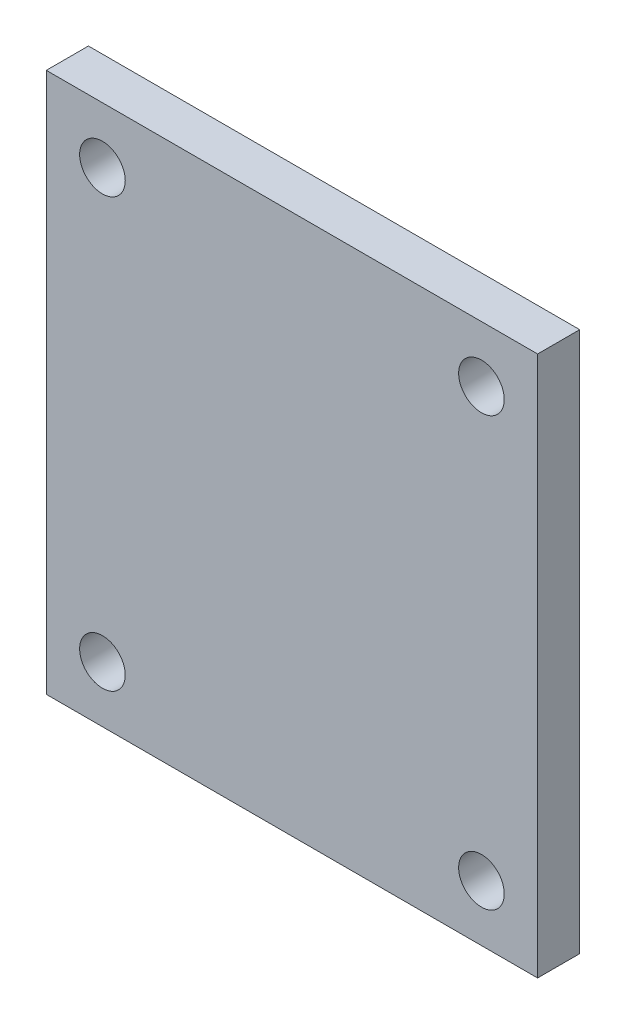
ISO-10303-21;
HEADER;
FILE_DESCRIPTION(('STEP AP214'),'2;1');
FILE_NAME('part.step','',(''),(''),'','','');
FILE_SCHEMA(('AUTOMOTIVE_DESIGN { 1 0 10303 214 1 1 1 1 }'));
ENDSEC;
DATA;
#1=APPLICATION_CONTEXT('core data for automotive mechanical design processes');
#2=APPLICATION_PROTOCOL_DEFINITION('international standard','automotive_design',2000,#1);
#3=PRODUCT_CONTEXT('',#1,'mechanical');
#4=PRODUCT('Part','Part','',(#3));
#5=PRODUCT_RELATED_PRODUCT_CATEGORY('part','',(#4));
#6=PRODUCT_DEFINITION_FORMATION('','',#4);
#7=PRODUCT_DEFINITION_CONTEXT('part definition',#1,'design');
#8=PRODUCT_DEFINITION('design','',#6,#7);
#9=PRODUCT_DEFINITION_SHAPE('','',#8);
#10=(LENGTH_UNIT() NAMED_UNIT(*) SI_UNIT(.MILLI.,.METRE.));
#11=(NAMED_UNIT(*) PLANE_ANGLE_UNIT() SI_UNIT($,.RADIAN.));
#12=(NAMED_UNIT(*) SI_UNIT($,.STERADIAN.) SOLID_ANGLE_UNIT());
#13=UNCERTAINTY_MEASURE_WITH_UNIT(LENGTH_MEASURE(1.E-05),#10,'distance_accuracy_value','');
#14=(GEOMETRIC_REPRESENTATION_CONTEXT(3) GLOBAL_UNCERTAINTY_ASSIGNED_CONTEXT((#13)) GLOBAL_UNIT_ASSIGNED_CONTEXT((#10,
#11,#12)) REPRESENTATION_CONTEXT('',''));
#15=CARTESIAN_POINT('',(0.,0.,0.));
#16=DIRECTION('',(0.,0.,1.));
#17=DIRECTION('',(1.,0.,0.));
#18=AXIS2_PLACEMENT_3D('',#15,#16,#17);
#19=CARTESIAN_POINT('',(0.,0.,6.));
#20=DIRECTION('',(0.,0.,-1.));
#21=DIRECTION('',(-1.,0.,0.));
#22=AXIS2_PLACEMENT_3D('',#19,#20,#21);
#23=PLANE('',#22);
#24=CARTESIAN_POINT('',(-54.,-61.,6.));
#25=DIRECTION('',(0.,0.,1.));
#26=DIRECTION('',(-1.,0.,0.));
#27=AXIS2_PLACEMENT_3D('',#24,#25,#26);
#28=CIRCLE('',#27,6.50000000000002);
#29=CARTESIAN_POINT('',(-60.5,-61.,6.));
#30=VERTEX_POINT('',#29);
#31=EDGE_CURVE('E123',#30,#30,#28,.T.);
#32=ORIENTED_EDGE('',*,*,#31,.F.);
#33=EDGE_LOOP('',(#32));
#34=FACE_BOUND('',#33,.T.);
#35=CARTESIAN_POINT('',(-54.,61.,6.));
#36=DIRECTION('',(0.,0.,1.));
#37=DIRECTION('',(1.,0.,0.));
#38=AXIS2_PLACEMENT_3D('',#35,#36,#37);
#39=CIRCLE('',#38,6.50000000000002);
#40=CARTESIAN_POINT('',(-47.5,61.,6.));
#41=VERTEX_POINT('',#40);
#42=EDGE_CURVE('E102',#41,#41,#39,.T.);
#43=ORIENTED_EDGE('',*,*,#42,.F.);
#44=EDGE_LOOP('',(#43));
#45=FACE_BOUND('',#44,.T.);
#46=DIRECTION('',(0.,-1.,0.));
#47=VECTOR('',#46,1.);
#48=CARTESIAN_POINT('',(-70.,-77.,6.));
#49=LINE('',#48,#47);
#50=CARTESIAN_POINT('',(-70.,77.,6.));
#51=VERTEX_POINT('',#50);
#52=CARTESIAN_POINT('',(-70.,-77.,6.));
#53=VERTEX_POINT('',#52);
#54=EDGE_CURVE('E87',#51,#53,#49,.T.);
#55=ORIENTED_EDGE('',*,*,#54,.T.);
#56=DIRECTION('',(1.,0.,0.));
#57=VECTOR('',#56,1.);
#58=CARTESIAN_POINT('',(-70.,-77.,6.));
#59=LINE('',#58,#57);
#60=CARTESIAN_POINT('',(70.,-77.,6.));
#61=VERTEX_POINT('',#60);
#62=EDGE_CURVE('E82',#53,#61,#59,.T.);
#63=ORIENTED_EDGE('',*,*,#62,.T.);
#64=DIRECTION('',(0.,1.,0.));
#65=VECTOR('',#64,1.);
#66=CARTESIAN_POINT('',(70.,-77.,6.));
#67=LINE('',#66,#65);
#68=CARTESIAN_POINT('',(70.,77.,6.));
#69=VERTEX_POINT('',#68);
#70=EDGE_CURVE('E85',#61,#69,#67,.T.);
#71=ORIENTED_EDGE('',*,*,#70,.T.);
#72=DIRECTION('',(-1.,0.,0.));
#73=VECTOR('',#72,1.);
#74=CARTESIAN_POINT('',(-70.,77.,6.));
#75=LINE('',#74,#73);
#76=EDGE_CURVE('E52',#69,#51,#75,.T.);
#77=ORIENTED_EDGE('',*,*,#76,.T.);
#78=EDGE_LOOP('',(#55,#63,#71,#77));
#79=FACE_BOUND('',#78,.T.);
#80=CARTESIAN_POINT('',(54.,61.,6.));
#81=DIRECTION('',(0.,0.,1.));
#82=DIRECTION('',(-1.,0.,0.));
#83=AXIS2_PLACEMENT_3D('',#80,#81,#82);
#84=CIRCLE('',#83,6.50000000000001);
#85=CARTESIAN_POINT('',(47.5,61.,6.));
#86=VERTEX_POINT('',#85);
#87=EDGE_CURVE('E117',#86,#86,#84,.T.);
#88=ORIENTED_EDGE('',*,*,#87,.F.);
#89=EDGE_LOOP('',(#88));
#90=FACE_BOUND('',#89,.T.);
#91=CARTESIAN_POINT('',(54.,-61.,6.));
#92=DIRECTION('',(0.,0.,1.));
#93=DIRECTION('',(1.,0.,0.));
#94=AXIS2_PLACEMENT_3D('',#91,#92,#93);
#95=CIRCLE('',#94,6.50000000000001);
#96=CARTESIAN_POINT('',(60.5000000000001,-61.,6.));
#97=VERTEX_POINT('',#96);
#98=EDGE_CURVE('E129',#97,#97,#95,.T.);
#99=ORIENTED_EDGE('',*,*,#98,.F.);
#100=EDGE_LOOP('',(#99));
#101=FACE_BOUND('',#100,.T.);
#102=ADVANCED_FACE('F35',(#34,#45,#79,#90,#101),#23,.F.);
#103=CARTESIAN_POINT('',(0.,0.,-6.));
#104=DIRECTION('',(0.,0.,-1.));
#105=DIRECTION('',(-1.,0.,0.));
#106=AXIS2_PLACEMENT_3D('',#103,#104,#105);
#107=PLANE('',#106);
#108=CARTESIAN_POINT('',(-54.,-61.,-6.));
#109=DIRECTION('',(0.,0.,1.));
#110=DIRECTION('',(-1.,0.,0.));
#111=AXIS2_PLACEMENT_3D('',#108,#109,#110);
#112=CIRCLE('',#111,6.50000000000002);
#113=CARTESIAN_POINT('',(-60.5,-61.,-6.));
#114=VERTEX_POINT('',#113);
#115=EDGE_CURVE('E126',#114,#114,#112,.T.);
#116=ORIENTED_EDGE('',*,*,#115,.T.);
#117=EDGE_LOOP('',(#116));
#118=FACE_BOUND('',#117,.T.);
#119=CARTESIAN_POINT('',(-54.,61.,-6.));
#120=DIRECTION('',(0.,0.,1.));
#121=DIRECTION('',(1.,0.,0.));
#122=AXIS2_PLACEMENT_3D('',#119,#120,#121);
#123=CIRCLE('',#122,6.50000000000002);
#124=CARTESIAN_POINT('',(-47.5,61.,-6.));
#125=VERTEX_POINT('',#124);
#126=EDGE_CURVE('E114',#125,#125,#123,.T.);
#127=ORIENTED_EDGE('',*,*,#126,.T.);
#128=EDGE_LOOP('',(#127));
#129=FACE_BOUND('',#128,.T.);
#130=DIRECTION('',(0.,-1.,0.));
#131=VECTOR('',#130,1.);
#132=CARTESIAN_POINT('',(-70.,-77.,-6.));
#133=LINE('',#132,#131);
#134=CARTESIAN_POINT('',(-70.,77.,-6.));
#135=VERTEX_POINT('',#134);
#136=CARTESIAN_POINT('',(-70.,-77.,-6.));
#137=VERTEX_POINT('',#136);
#138=EDGE_CURVE('E99',#135,#137,#133,.T.);
#139=ORIENTED_EDGE('',*,*,#138,.F.);
#140=DIRECTION('',(-1.,0.,0.));
#141=VECTOR('',#140,1.);
#142=CARTESIAN_POINT('',(-70.,77.,-6.));
#143=LINE('',#142,#141);
#144=CARTESIAN_POINT('',(70.,77.,-6.));
#145=VERTEX_POINT('',#144);
#146=EDGE_CURVE('E75',#145,#135,#143,.T.);
#147=ORIENTED_EDGE('',*,*,#146,.F.);
#148=DIRECTION('',(0.,1.,0.));
#149=VECTOR('',#148,1.);
#150=CARTESIAN_POINT('',(70.,-77.,-6.));
#151=LINE('',#150,#149);
#152=CARTESIAN_POINT('',(70.,-77.,-6.));
#153=VERTEX_POINT('',#152);
#154=EDGE_CURVE('E69',#153,#145,#151,.T.);
#155=ORIENTED_EDGE('',*,*,#154,.F.);
#156=DIRECTION('',(1.,0.,0.));
#157=VECTOR('',#156,1.);
#158=CARTESIAN_POINT('',(-70.,-77.,-6.));
#159=LINE('',#158,#157);
#160=EDGE_CURVE('E91',#137,#153,#159,.T.);
#161=ORIENTED_EDGE('',*,*,#160,.F.);
#162=EDGE_LOOP('',(#139,#147,#155,#161));
#163=FACE_BOUND('',#162,.T.);
#164=CARTESIAN_POINT('',(54.,61.,-6.));
#165=DIRECTION('',(0.,0.,1.));
#166=DIRECTION('',(-1.,0.,0.));
#167=AXIS2_PLACEMENT_3D('',#164,#165,#166);
#168=CIRCLE('',#167,6.50000000000001);
#169=CARTESIAN_POINT('',(47.5,61.,-6.));
#170=VERTEX_POINT('',#169);
#171=EDGE_CURVE('E120',#170,#170,#168,.T.);
#172=ORIENTED_EDGE('',*,*,#171,.T.);
#173=EDGE_LOOP('',(#172));
#174=FACE_BOUND('',#173,.T.);
#175=CARTESIAN_POINT('',(54.,-61.,-6.));
#176=DIRECTION('',(0.,0.,1.));
#177=DIRECTION('',(1.,0.,0.));
#178=AXIS2_PLACEMENT_3D('',#175,#176,#177);
#179=CIRCLE('',#178,6.50000000000001);
#180=CARTESIAN_POINT('',(60.5000000000001,-61.,-6.));
#181=VERTEX_POINT('',#180);
#182=EDGE_CURVE('E132',#181,#181,#179,.T.);
#183=ORIENTED_EDGE('',*,*,#182,.T.);
#184=EDGE_LOOP('',(#183));
#185=FACE_BOUND('',#184,.T.);
#186=ADVANCED_FACE('F110',(#118,#129,#163,#174,#185),#107,.T.);
#187=CARTESIAN_POINT('',(-70.,-77.,6.));
#188=DIRECTION('',(1.,0.,0.));
#189=DIRECTION('',(0.,0.,-1.));
#190=AXIS2_PLACEMENT_3D('',#187,#188,#189);
#191=PLANE('',#190);
#192=ORIENTED_EDGE('',*,*,#138,.T.);
#193=DIRECTION('',(0.,0.,-1.));
#194=VECTOR('',#193,1.);
#195=CARTESIAN_POINT('',(-70.,-77.,6.));
#196=LINE('',#195,#194);
#197=EDGE_CURVE('E11',#53,#137,#196,.T.);
#198=ORIENTED_EDGE('',*,*,#197,.F.);
#199=ORIENTED_EDGE('',*,*,#54,.F.);
#200=DIRECTION('',(0.,0.,-1.));
#201=VECTOR('',#200,1.);
#202=CARTESIAN_POINT('',(-70.,77.,6.));
#203=LINE('',#202,#201);
#204=EDGE_CURVE('E95',#51,#135,#203,.T.);
#205=ORIENTED_EDGE('',*,*,#204,.T.);
#206=EDGE_LOOP('',(#192,#198,#199,#205));
#207=FACE_BOUND('',#206,.T.);
#208=ADVANCED_FACE('F37',(#207),#191,.F.);
#209=CARTESIAN_POINT('',(-70.,-77.,6.));
#210=DIRECTION('',(0.,1.,0.));
#211=DIRECTION('',(0.,0.,1.));
#212=AXIS2_PLACEMENT_3D('',#209,#210,#211);
#213=PLANE('',#212);
#214=ORIENTED_EDGE('',*,*,#160,.T.);
#215=DIRECTION('',(0.,0.,-1.));
#216=VECTOR('',#215,1.);
#217=CARTESIAN_POINT('',(70.,-77.,6.));
#218=LINE('',#217,#216);
#219=EDGE_CURVE('E44',#61,#153,#218,.T.);
#220=ORIENTED_EDGE('',*,*,#219,.F.);
#221=ORIENTED_EDGE('',*,*,#62,.F.);
#222=ORIENTED_EDGE('',*,*,#197,.T.);
#223=EDGE_LOOP('',(#214,#220,#221,#222));
#224=FACE_BOUND('',#223,.T.);
#225=ADVANCED_FACE('F90',(#224),#213,.F.);
#226=CARTESIAN_POINT('',(70.,-77.,6.));
#227=DIRECTION('',(-1.,0.,0.));
#228=DIRECTION('',(0.,0.,1.));
#229=AXIS2_PLACEMENT_3D('',#226,#227,#228);
#230=PLANE('',#229);
#231=ORIENTED_EDGE('',*,*,#154,.T.);
#232=DIRECTION('',(0.,0.,-1.));
#233=VECTOR('',#232,1.);
#234=CARTESIAN_POINT('',(70.,77.,6.));
#235=LINE('',#234,#233);
#236=EDGE_CURVE('E92',#69,#145,#235,.T.);
#237=ORIENTED_EDGE('',*,*,#236,.F.);
#238=ORIENTED_EDGE('',*,*,#70,.F.);
#239=ORIENTED_EDGE('',*,*,#219,.T.);
#240=EDGE_LOOP('',(#231,#237,#238,#239));
#241=FACE_BOUND('',#240,.T.);
#242=ADVANCED_FACE('F93',(#241),#230,.F.);
#243=CARTESIAN_POINT('',(-70.,77.,6.));
#244=DIRECTION('',(0.,-1.,0.));
#245=DIRECTION('',(0.,0.,-1.));
#246=AXIS2_PLACEMENT_3D('',#243,#244,#245);
#247=PLANE('',#246);
#248=ORIENTED_EDGE('',*,*,#146,.T.);
#249=ORIENTED_EDGE('',*,*,#204,.F.);
#250=ORIENTED_EDGE('',*,*,#76,.F.);
#251=ORIENTED_EDGE('',*,*,#236,.T.);
#252=EDGE_LOOP('',(#248,#249,#250,#251));
#253=FACE_BOUND('',#252,.T.);
#254=ADVANCED_FACE('F107',(#253),#247,.F.);
#255=CARTESIAN_POINT('',(-54.,61.,6.));
#256=DIRECTION('',(0.,0.,-1.));
#257=DIRECTION('',(-1.,0.,0.));
#258=AXIS2_PLACEMENT_3D('',#255,#256,#257);
#259=CYLINDRICAL_SURFACE('',#258,6.50000000000002);
#260=ORIENTED_EDGE('',*,*,#42,.T.);
#261=EDGE_LOOP('',(#260));
#262=FACE_BOUND('',#261,.T.);
#263=ORIENTED_EDGE('',*,*,#126,.F.);
#264=EDGE_LOOP('',(#263));
#265=FACE_BOUND('',#264,.T.);
#266=ADVANCED_FACE('F152',(#262,#265),#259,.F.);
#267=CARTESIAN_POINT('',(54.,61.,6.));
#268=DIRECTION('',(0.,0.,-1.));
#269=DIRECTION('',(-1.,0.,0.));
#270=AXIS2_PLACEMENT_3D('',#267,#268,#269);
#271=CYLINDRICAL_SURFACE('',#270,6.50000000000001);
#272=ORIENTED_EDGE('',*,*,#87,.T.);
#273=EDGE_LOOP('',(#272));
#274=FACE_BOUND('',#273,.T.);
#275=ORIENTED_EDGE('',*,*,#171,.F.);
#276=EDGE_LOOP('',(#275));
#277=FACE_BOUND('',#276,.T.);
#278=ADVANCED_FACE('F198',(#274,#277),#271,.F.);
#279=CARTESIAN_POINT('',(-54.,-61.,6.));
#280=DIRECTION('',(0.,0.,-1.));
#281=DIRECTION('',(-1.,0.,0.));
#282=AXIS2_PLACEMENT_3D('',#279,#280,#281);
#283=CYLINDRICAL_SURFACE('',#282,6.50000000000002);
#284=ORIENTED_EDGE('',*,*,#31,.T.);
#285=EDGE_LOOP('',(#284));
#286=FACE_BOUND('',#285,.T.);
#287=ORIENTED_EDGE('',*,*,#115,.F.);
#288=EDGE_LOOP('',(#287));
#289=FACE_BOUND('',#288,.T.);
#290=ADVANCED_FACE('F206',(#286,#289),#283,.F.);
#291=CARTESIAN_POINT('',(54.,-61.,6.));
#292=DIRECTION('',(0.,0.,-1.));
#293=DIRECTION('',(-1.,0.,0.));
#294=AXIS2_PLACEMENT_3D('',#291,#292,#293);
#295=CYLINDRICAL_SURFACE('',#294,6.50000000000001);
#296=ORIENTED_EDGE('',*,*,#98,.T.);
#297=EDGE_LOOP('',(#296));
#298=FACE_BOUND('',#297,.T.);
#299=ORIENTED_EDGE('',*,*,#182,.F.);
#300=EDGE_LOOP('',(#299));
#301=FACE_BOUND('',#300,.T.);
#302=ADVANCED_FACE('F138',(#298,#301),#295,.F.);
#303=CLOSED_SHELL('',(#102,#186,#208,#225,#242,#254,#266,#278,#290,#302));
#304=MANIFOLD_SOLID_BREP('B2',#303);
#305=ADVANCED_BREP_SHAPE_REPRESENTATION('',(#18,#304),#14);
#306=SHAPE_DEFINITION_REPRESENTATION(#9,#305);
ENDSEC;
END-ISO-10303-21;
